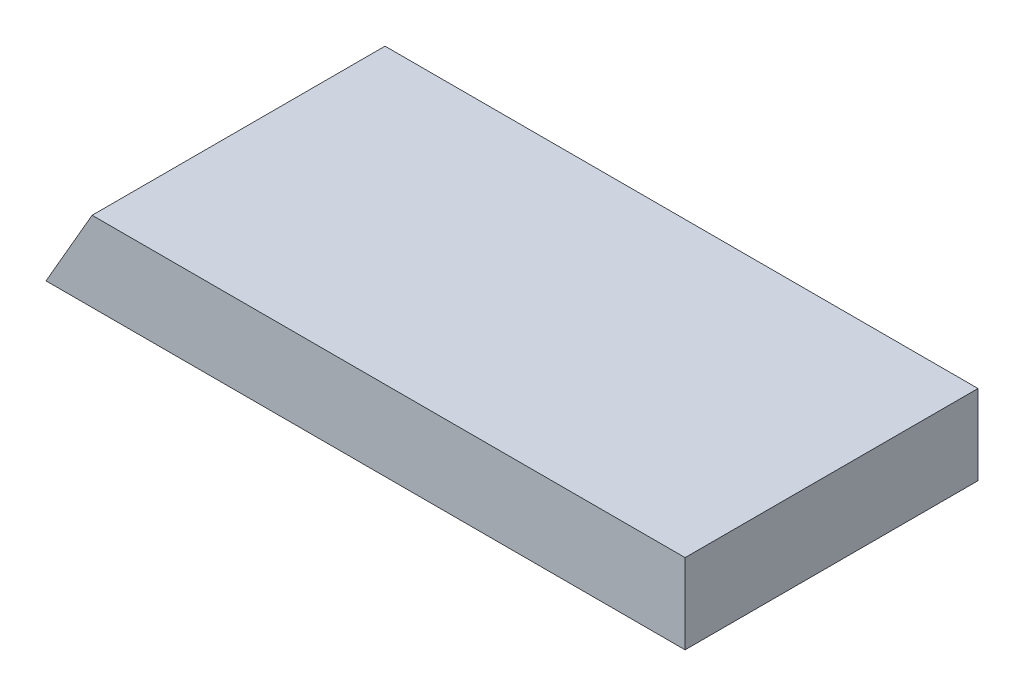
ISO-10303-21;
HEADER;
FILE_DESCRIPTION(('STEP AP214'),'2;1');
FILE_NAME('part.step','',(''),(''),'','','');
FILE_SCHEMA(('AUTOMOTIVE_DESIGN { 1 0 10303 214 1 1 1 1 }'));
ENDSEC;
DATA;
#1=APPLICATION_CONTEXT('core data for automotive mechanical design processes');
#2=APPLICATION_PROTOCOL_DEFINITION('international standard','automotive_design',2000,#1);
#3=PRODUCT_CONTEXT('',#1,'mechanical');
#4=PRODUCT('Part','Part','',(#3));
#5=PRODUCT_RELATED_PRODUCT_CATEGORY('part','',(#4));
#6=PRODUCT_DEFINITION_FORMATION('','',#4);
#7=PRODUCT_DEFINITION_CONTEXT('part definition',#1,'design');
#8=PRODUCT_DEFINITION('design','',#6,#7);
#9=PRODUCT_DEFINITION_SHAPE('','',#8);
#10=(LENGTH_UNIT() NAMED_UNIT(*) SI_UNIT(.MILLI.,.METRE.));
#11=(NAMED_UNIT(*) PLANE_ANGLE_UNIT() SI_UNIT($,.RADIAN.));
#12=(NAMED_UNIT(*) SI_UNIT($,.STERADIAN.) SOLID_ANGLE_UNIT());
#13=UNCERTAINTY_MEASURE_WITH_UNIT(LENGTH_MEASURE(1.E-05),#10,'distance_accuracy_value','');
#14=(GEOMETRIC_REPRESENTATION_CONTEXT(3) GLOBAL_UNCERTAINTY_ASSIGNED_CONTEXT((#13)) GLOBAL_UNIT_ASSIGNED_CONTEXT((#10,
#11,#12)) REPRESENTATION_CONTEXT('',''));
#15=CARTESIAN_POINT('',(0.,0.,0.));
#16=DIRECTION('',(0.,0.,1.));
#17=DIRECTION('',(1.,0.,0.));
#18=AXIS2_PLACEMENT_3D('',#15,#16,#17);
#19=CARTESIAN_POINT('',(1.56732393548964,38.1,0.));
#20=DIRECTION('',(0.,0.,-1.));
#21=DIRECTION('',(-1.,0.,0.));
#22=AXIS2_PLACEMENT_3D('',#19,#20,#21);
#23=PLANE('',#22);
#24=DIRECTION('',(1.,0.,0.));
#25=VECTOR('',#24,1.);
#26=CARTESIAN_POINT('',(1.56732393548964,38.1,0.));
#27=LINE('',#26,#25);
#28=CARTESIAN_POINT('',(23.5643691916146,38.1,0.));
#29=VERTEX_POINT('',#28);
#30=CARTESIAN_POINT('',(306.36732393549,38.1,0.));
#31=VERTEX_POINT('',#30);
#32=EDGE_CURVE('E84',#29,#31,#27,.T.);
#33=ORIENTED_EDGE('',*,*,#32,.F.);
#34=DIRECTION('',(-0.500000000000004,-0.866025403784437,0.));
#35=VECTOR('',#34,1.);
#36=CARTESIAN_POINT('',(18.0651078775833,28.5749999999999,0.));
#37=LINE('',#36,#35);
#38=CARTESIAN_POINT('',(1.56732393548964,0.,0.));
#39=VERTEX_POINT('',#38);
#40=EDGE_CURVE('E83',#29,#39,#37,.T.);
#41=ORIENTED_EDGE('',*,*,#40,.T.);
#42=DIRECTION('',(1.,0.,0.));
#43=VECTOR('',#42,1.);
#44=CARTESIAN_POINT('',(1.56732393548964,0.,0.));
#45=LINE('',#44,#43);
#46=CARTESIAN_POINT('',(306.36732393549,0.,0.));
#47=VERTEX_POINT('',#46);
#48=EDGE_CURVE('E72',#39,#47,#45,.T.);
#49=ORIENTED_EDGE('',*,*,#48,.T.);
#50=DIRECTION('',(0.,-1.,0.));
#51=VECTOR('',#50,1.);
#52=CARTESIAN_POINT('',(306.36732393549,38.1,0.));
#53=LINE('',#52,#51);
#54=EDGE_CURVE('E11',#31,#47,#53,.T.);
#55=ORIENTED_EDGE('',*,*,#54,.F.);
#56=EDGE_LOOP('',(#33,#41,#49,#55));
#57=FACE_BOUND('',#56,.T.);
#58=ADVANCED_FACE('F31',(#57),#23,.F.);
#59=CARTESIAN_POINT('',(306.36732393549,38.1,0.));
#60=DIRECTION('',(-1.,0.,0.));
#61=DIRECTION('',(0.,0.,1.));
#62=AXIS2_PLACEMENT_3D('',#59,#60,#61);
#63=PLANE('',#62);
#64=DIRECTION('',(0.,0.,-1.));
#65=VECTOR('',#64,1.);
#66=CARTESIAN_POINT('',(306.36732393549,0.,0.));
#67=LINE('',#66,#65);
#68=CARTESIAN_POINT('',(306.36732393549,0.,-139.7));
#69=VERTEX_POINT('',#68);
#70=EDGE_CURVE('E78',#47,#69,#67,.T.);
#71=ORIENTED_EDGE('',*,*,#70,.T.);
#72=DIRECTION('',(0.,-1.,0.));
#73=VECTOR('',#72,1.);
#74=CARTESIAN_POINT('',(306.36732393549,38.1,-139.7));
#75=LINE('',#74,#73);
#76=CARTESIAN_POINT('',(306.36732393549,38.1,-139.7));
#77=VERTEX_POINT('',#76);
#78=EDGE_CURVE('E38',#77,#69,#75,.T.);
#79=ORIENTED_EDGE('',*,*,#78,.F.);
#80=DIRECTION('',(0.,0.,-1.));
#81=VECTOR('',#80,1.);
#82=CARTESIAN_POINT('',(306.36732393549,38.1,0.));
#83=LINE('',#82,#81);
#84=EDGE_CURVE('E97',#31,#77,#83,.T.);
#85=ORIENTED_EDGE('',*,*,#84,.F.);
#86=ORIENTED_EDGE('',*,*,#54,.T.);
#87=EDGE_LOOP('',(#71,#79,#85,#86));
#88=FACE_BOUND('',#87,.T.);
#89=ADVANCED_FACE('F104',(#88),#63,.F.);
#90=CARTESIAN_POINT('',(1.56732393548964,38.1,-139.7));
#91=DIRECTION('',(0.,0.,1.));
#92=DIRECTION('',(1.,0.,0.));
#93=AXIS2_PLACEMENT_3D('',#90,#91,#92);
#94=PLANE('',#93);
#95=DIRECTION('',(-1.,0.,0.));
#96=VECTOR('',#95,1.);
#97=CARTESIAN_POINT('',(1.56732393548964,0.,-139.7));
#98=LINE('',#97,#96);
#99=CARTESIAN_POINT('',(1.56732393548964,0.,-139.7));
#100=VERTEX_POINT('',#99);
#101=EDGE_CURVE('E94',#69,#100,#98,.T.);
#102=ORIENTED_EDGE('',*,*,#101,.T.);
#103=DIRECTION('',(0.500000000000004,0.866025403784437,0.));
#104=VECTOR('',#103,1.);
#105=CARTESIAN_POINT('',(18.0651078775833,28.5749999999999,-139.7));
#106=LINE('',#105,#104);
#107=CARTESIAN_POINT('',(23.5643691916146,38.1,-139.7));
#108=VERTEX_POINT('',#107);
#109=EDGE_CURVE('E45',#100,#108,#106,.T.);
#110=ORIENTED_EDGE('',*,*,#109,.T.);
#111=DIRECTION('',(-1.,0.,0.));
#112=VECTOR('',#111,1.);
#113=CARTESIAN_POINT('',(1.56732393548964,38.1,-139.7));
#114=LINE('',#113,#112);
#115=EDGE_CURVE('E90',#77,#108,#114,.T.);
#116=ORIENTED_EDGE('',*,*,#115,.F.);
#117=ORIENTED_EDGE('',*,*,#78,.T.);
#118=EDGE_LOOP('',(#102,#110,#116,#117));
#119=FACE_BOUND('',#118,.T.);
#120=ADVANCED_FACE('F105',(#119),#94,.F.);
#121=CARTESIAN_POINT('',(1.56732393548964,38.1,-139.7));
#122=DIRECTION('',(0.,-1.,0.));
#123=DIRECTION('',(0.,0.,-1.));
#124=AXIS2_PLACEMENT_3D('',#121,#122,#123);
#125=PLANE('',#124);
#126=ORIENTED_EDGE('',*,*,#115,.T.);
#127=DIRECTION('',(0.,0.,1.));
#128=VECTOR('',#127,1.);
#129=CARTESIAN_POINT('',(23.5643691916146,38.1,-736.134235614869));
#130=LINE('',#129,#128);
#131=EDGE_CURVE('E52',#108,#29,#130,.T.);
#132=ORIENTED_EDGE('',*,*,#131,.T.);
#133=ORIENTED_EDGE('',*,*,#32,.T.);
#134=ORIENTED_EDGE('',*,*,#84,.T.);
#135=EDGE_LOOP('',(#126,#132,#133,#134));
#136=FACE_BOUND('',#135,.T.);
#137=ADVANCED_FACE('F102',(#136),#125,.F.);
#138=CARTESIAN_POINT('',(1.56732393548964,0.,-139.7));
#139=DIRECTION('',(0.,-1.,0.));
#140=DIRECTION('',(0.,0.,-1.));
#141=AXIS2_PLACEMENT_3D('',#138,#139,#140);
#142=PLANE('',#141);
#143=DIRECTION('',(0.,0.,1.));
#144=VECTOR('',#143,1.);
#145=CARTESIAN_POINT('',(1.56732393548964,0.,0.));
#146=LINE('',#145,#144);
#147=EDGE_CURVE('E77',#100,#39,#146,.T.);
#148=ORIENTED_EDGE('',*,*,#147,.F.);
#149=ORIENTED_EDGE('',*,*,#101,.F.);
#150=ORIENTED_EDGE('',*,*,#70,.F.);
#151=ORIENTED_EDGE('',*,*,#48,.F.);
#152=EDGE_LOOP('',(#148,#149,#150,#151));
#153=FACE_BOUND('',#152,.T.);
#154=ADVANCED_FACE('F74',(#153),#142,.T.);
#155=CARTESIAN_POINT('',(1.56732393548964,0.,-736.134235614869));
#156=DIRECTION('',(0.866025403784437,-0.500000000000004,0.));
#157=DIRECTION('',(0.500000000000004,0.866025403784437,0.));
#158=AXIS2_PLACEMENT_3D('',#155,#156,#157);
#159=PLANE('',#158);
#160=ORIENTED_EDGE('',*,*,#40,.F.);
#161=ORIENTED_EDGE('',*,*,#131,.F.);
#162=ORIENTED_EDGE('',*,*,#109,.F.);
#163=ORIENTED_EDGE('',*,*,#147,.T.);
#164=EDGE_LOOP('',(#160,#161,#162,#163));
#165=FACE_BOUND('',#164,.T.);
#166=ADVANCED_FACE('F87',(#165),#159,.F.);
#167=CLOSED_SHELL('',(#58,#89,#120,#137,#154,#166));
#168=MANIFOLD_SOLID_BREP('B2',#167);
#169=ADVANCED_BREP_SHAPE_REPRESENTATION('',(#18,#168),#14);
#170=SHAPE_DEFINITION_REPRESENTATION(#9,#169);
ENDSEC;
END-ISO-10303-21;
